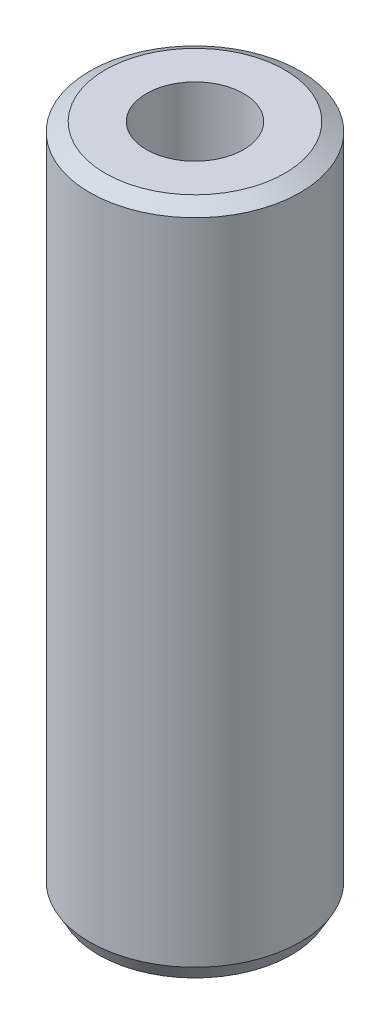
ISO-10303-21;
HEADER;
FILE_DESCRIPTION(('STEP AP214'),'2;1');
FILE_NAME('part.step','',(''),(''),'','','');
FILE_SCHEMA(('AUTOMOTIVE_DESIGN { 1 0 10303 214 1 1 1 1 }'));
ENDSEC;
DATA;
#1=APPLICATION_CONTEXT('core data for automotive mechanical design processes');
#2=APPLICATION_PROTOCOL_DEFINITION('international standard','automotive_design',2000,#1);
#3=PRODUCT_CONTEXT('',#1,'mechanical');
#4=PRODUCT('Part','Part','',(#3));
#5=PRODUCT_RELATED_PRODUCT_CATEGORY('part','',(#4));
#6=PRODUCT_DEFINITION_FORMATION('','',#4);
#7=PRODUCT_DEFINITION_CONTEXT('part definition',#1,'design');
#8=PRODUCT_DEFINITION('design','',#6,#7);
#9=PRODUCT_DEFINITION_SHAPE('','',#8);
#10=(LENGTH_UNIT() NAMED_UNIT(*) SI_UNIT(.MILLI.,.METRE.));
#11=(NAMED_UNIT(*) PLANE_ANGLE_UNIT() SI_UNIT($,.RADIAN.));
#12=(NAMED_UNIT(*) SI_UNIT($,.STERADIAN.) SOLID_ANGLE_UNIT());
#13=UNCERTAINTY_MEASURE_WITH_UNIT(LENGTH_MEASURE(1.E-05),#10,'distance_accuracy_value','');
#14=(GEOMETRIC_REPRESENTATION_CONTEXT(3) GLOBAL_UNCERTAINTY_ASSIGNED_CONTEXT((#13)) GLOBAL_UNIT_ASSIGNED_CONTEXT((#10,
#11,#12)) REPRESENTATION_CONTEXT('',''));
#15=CARTESIAN_POINT('',(0.,0.,0.));
#16=DIRECTION('',(0.,0.,1.));
#17=DIRECTION('',(1.,0.,0.));
#18=AXIS2_PLACEMENT_3D('',#15,#16,#17);
#19=CARTESIAN_POINT('',(0.,351.937780791658,0.));
#20=DIRECTION('',(0.,-1.,0.));
#21=DIRECTION('',(0.,0.,-1.));
#22=AXIS2_PLACEMENT_3D('',#19,#20,#21);
#23=CYLINDRICAL_SURFACE('',#22,55.);
#24=CARTESIAN_POINT('',(0.,347.298029339497,0.));
#25=DIRECTION('',(0.,1.,0.));
#26=DIRECTION('',(0.,0.,1.));
#27=AXIS2_PLACEMENT_3D('',#24,#25,#26);
#28=CIRCLE('',#27,55.);
#29=CARTESIAN_POINT('',(0.,347.298029339497,55.));
#30=VERTEX_POINT('',#29);
#31=EDGE_CURVE('E50',#30,#30,#28,.F.);
#32=ORIENTED_EDGE('',*,*,#31,.T.);
#33=EDGE_LOOP('',(#32));
#34=FACE_BOUND('',#33,.T.);
#35=CARTESIAN_POINT('',(0.,8.12495388769791,0.));
#36=DIRECTION('',(0.,1.,0.));
#37=DIRECTION('',(0.,0.,1.));
#38=AXIS2_PLACEMENT_3D('',#35,#36,#37);
#39=CIRCLE('',#38,55.);
#40=CARTESIAN_POINT('',(0.,8.12495388769791,55.));
#41=VERTEX_POINT('',#40);
#42=EDGE_CURVE('E51',#41,#41,#39,.T.);
#43=ORIENTED_EDGE('',*,*,#42,.T.);
#44=EDGE_LOOP('',(#43));
#45=FACE_BOUND('',#44,.T.);
#46=ADVANCED_FACE('F39',(#34,#45),#23,.T.);
#47=CARTESIAN_POINT('',(0.,351.937780791658,0.));
#48=DIRECTION('',(0.,1.,0.));
#49=DIRECTION('',(0.,0.,1.));
#50=AXIS2_PLACEMENT_3D('',#47,#48,#49);
#51=PLANE('',#50);
#52=CARTESIAN_POINT('',(0.,351.937780791658,0.));
#53=DIRECTION('',(0.,1.,0.));
#54=DIRECTION('',(0.,0.,1.));
#55=AXIS2_PLACEMENT_3D('',#52,#53,#54);
#56=CIRCLE('',#55,46.8750461123022);
#57=CARTESIAN_POINT('',(0.,351.937780791658,46.8750461123022));
#58=VERTEX_POINT('',#57);
#59=EDGE_CURVE('E54',#58,#58,#56,.T.);
#60=ORIENTED_EDGE('',*,*,#59,.T.);
#61=EDGE_LOOP('',(#60));
#62=FACE_BOUND('',#61,.T.);
#63=CARTESIAN_POINT('',(0.,351.937780791658,0.));
#64=DIRECTION('',(0.,1.,0.));
#65=DIRECTION('',(0.,0.,1.));
#66=AXIS2_PLACEMENT_3D('',#63,#64,#65);
#67=CIRCLE('',#66,25.4015573590238);
#68=CARTESIAN_POINT('',(0.,351.937780791658,25.4015573590238));
#69=VERTEX_POINT('',#68);
#70=EDGE_CURVE('E58',#69,#69,#67,.T.);
#71=ORIENTED_EDGE('',*,*,#70,.F.);
#72=EDGE_LOOP('',(#71));
#73=FACE_BOUND('',#72,.T.);
#74=ADVANCED_FACE('F69',(#62,#73),#51,.T.);
#75=CARTESIAN_POINT('',(0.,0.,0.));
#76=DIRECTION('',(0.,1.,0.));
#77=DIRECTION('',(0.,0.,1.));
#78=AXIS2_PLACEMENT_3D('',#75,#76,#77);
#79=PLANE('',#78);
#80=CARTESIAN_POINT('',(0.,0.,0.));
#81=DIRECTION('',(0.,1.,0.));
#82=DIRECTION('',(0.,0.,1.));
#83=AXIS2_PLACEMENT_3D('',#80,#81,#82);
#84=CIRCLE('',#83,50.3602485478389);
#85=CARTESIAN_POINT('',(0.,0.,50.3602485478389));
#86=VERTEX_POINT('',#85);
#87=EDGE_CURVE('E10',#86,#86,#84,.F.);
#88=ORIENTED_EDGE('',*,*,#87,.T.);
#89=EDGE_LOOP('',(#88));
#90=FACE_BOUND('',#89,.T.);
#91=CARTESIAN_POINT('',(0.,0.,0.));
#92=DIRECTION('',(0.,1.,0.));
#93=DIRECTION('',(0.,0.,1.));
#94=AXIS2_PLACEMENT_3D('',#91,#92,#93);
#95=CIRCLE('',#94,25.4015573590238);
#96=CARTESIAN_POINT('',(0.,0.,25.4015573590238));
#97=VERTEX_POINT('',#96);
#98=EDGE_CURVE('E63',#97,#97,#95,.T.);
#99=ORIENTED_EDGE('',*,*,#98,.T.);
#100=EDGE_LOOP('',(#99));
#101=FACE_BOUND('',#100,.T.);
#102=ADVANCED_FACE('F75',(#90,#101),#79,.F.);
#103=CARTESIAN_POINT('',(0.,351.937780791658,0.));
#104=DIRECTION('',(0.,-1.,0.));
#105=DIRECTION('',(0.,0.,-1.));
#106=AXIS2_PLACEMENT_3D('',#103,#104,#105);
#107=CYLINDRICAL_SURFACE('',#106,25.4015573590238);
#108=ORIENTED_EDGE('',*,*,#70,.T.);
#109=EDGE_LOOP('',(#108));
#110=FACE_BOUND('',#109,.T.);
#111=ORIENTED_EDGE('',*,*,#98,.F.);
#112=EDGE_LOOP('',(#111));
#113=FACE_BOUND('',#112,.T.);
#114=ADVANCED_FACE('F70',(#110,#113),#107,.F.);
#115=CARTESIAN_POINT('',(0.,351.937780791658,0.));
#116=DIRECTION('',(0.,-1.,0.));
#117=DIRECTION('',(0.,0.,-1.));
#118=AXIS2_PLACEMENT_3D('',#115,#116,#117);
#119=CONICAL_SURFACE('',#118,46.8750461123022,1.05193596533431);
#120=ORIENTED_EDGE('',*,*,#31,.F.);
#121=EDGE_LOOP('',(#120));
#122=FACE_BOUND('',#121,.T.);
#123=ORIENTED_EDGE('',*,*,#59,.F.);
#124=EDGE_LOOP('',(#123));
#125=FACE_BOUND('',#124,.T.);
#126=ADVANCED_FACE('F81',(#122,#125),#119,.T.);
#127=CARTESIAN_POINT('',(0.,8.12495388769791,0.));
#128=DIRECTION('',(0.,1.,0.));
#129=DIRECTION('',(0.,0.,1.));
#130=AXIS2_PLACEMENT_3D('',#127,#128,#129);
#131=CONICAL_SURFACE('',#130,55.,0.518860361460582);
#132=ORIENTED_EDGE('',*,*,#87,.F.);
#133=EDGE_LOOP('',(#132));
#134=FACE_BOUND('',#133,.T.);
#135=ORIENTED_EDGE('',*,*,#42,.F.);
#136=EDGE_LOOP('',(#135));
#137=FACE_BOUND('',#136,.T.);
#138=ADVANCED_FACE('F45',(#134,#137),#131,.T.);
#139=CLOSED_SHELL('',(#46,#74,#102,#114,#126,#138));
#140=MANIFOLD_SOLID_BREP('B2',#139);
#141=ADVANCED_BREP_SHAPE_REPRESENTATION('',(#18,#140),#14);
#142=SHAPE_DEFINITION_REPRESENTATION(#9,#141);
ENDSEC;
END-ISO-10303-21;
